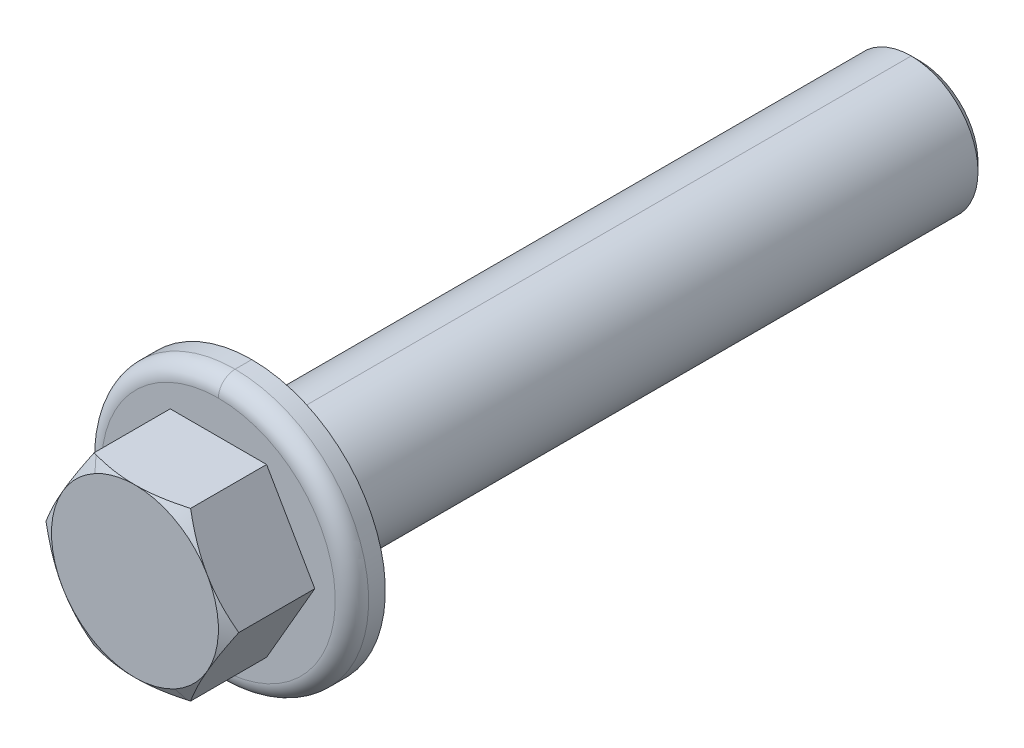
ISO-10303-21;
HEADER;
FILE_DESCRIPTION(('STEP AP214'),'2;1');
FILE_NAME('part.step','',(''),(''),'','','');
FILE_SCHEMA(('AUTOMOTIVE_DESIGN { 1 0 10303 214 1 1 1 1 }'));
ENDSEC;
DATA;
#1=APPLICATION_CONTEXT('core data for automotive mechanical design processes');
#2=APPLICATION_PROTOCOL_DEFINITION('international standard','automotive_design',2000,#1);
#3=PRODUCT_CONTEXT('',#1,'mechanical');
#4=PRODUCT('Part','Part','',(#3));
#5=PRODUCT_RELATED_PRODUCT_CATEGORY('part','',(#4));
#6=PRODUCT_DEFINITION_FORMATION('','',#4);
#7=PRODUCT_DEFINITION_CONTEXT('part definition',#1,'design');
#8=PRODUCT_DEFINITION('design','',#6,#7);
#9=PRODUCT_DEFINITION_SHAPE('','',#8);
#10=(LENGTH_UNIT() NAMED_UNIT(*) SI_UNIT(.MILLI.,.METRE.));
#11=(NAMED_UNIT(*) PLANE_ANGLE_UNIT() SI_UNIT($,.RADIAN.));
#12=(NAMED_UNIT(*) SI_UNIT($,.STERADIAN.) SOLID_ANGLE_UNIT());
#13=UNCERTAINTY_MEASURE_WITH_UNIT(LENGTH_MEASURE(1.E-05),#10,'distance_accuracy_value','');
#14=(GEOMETRIC_REPRESENTATION_CONTEXT(3) GLOBAL_UNCERTAINTY_ASSIGNED_CONTEXT((#13)) GLOBAL_UNIT_ASSIGNED_CONTEXT((#10,
#11,#12)) REPRESENTATION_CONTEXT('',''));
#15=CARTESIAN_POINT('',(0.,0.,0.));
#16=DIRECTION('',(0.,0.,1.));
#17=DIRECTION('',(1.,0.,0.));
#18=AXIS2_PLACEMENT_3D('',#15,#16,#17);
#19=CARTESIAN_POINT('',(62.,67.,26.1));
#20=DIRECTION('',(0.,0.,1.));
#21=DIRECTION('',(-1.,0.,0.));
#22=AXIS2_PLACEMENT_3D('',#19,#20,#21);
#23=TOROIDAL_SURFACE('',#22,4.25,0.25);
#24=CARTESIAN_POINT('',(62.,67.,26.35));
#25=DIRECTION('',(0.,0.,-1.));
#26=DIRECTION('',(1.,0.,0.));
#27=AXIS2_PLACEMENT_3D('',#24,#25,#26);
#28=CIRCLE('',#27,4.25);
#29=CARTESIAN_POINT('',(62.,71.25,26.35));
#30=VERTEX_POINT('',#29);
#31=CARTESIAN_POINT('',(62.,62.75,26.35));
#32=VERTEX_POINT('',#31);
#33=EDGE_CURVE('E11',#30,#32,#28,.T.);
#34=ORIENTED_EDGE('',*,*,#33,.T.);
#35=CARTESIAN_POINT('',(62.,62.75,26.1));
#36=DIRECTION('',(-1.,0.,0.));
#37=DIRECTION('',(0.,0.,1.));
#38=AXIS2_PLACEMENT_3D('',#35,#36,#37);
#39=CIRCLE('',#38,0.25);
#40=CARTESIAN_POINT('',(62.,63.,26.1));
#41=VERTEX_POINT('',#40);
#42=EDGE_CURVE('E33',#32,#41,#39,.T.);
#43=ORIENTED_EDGE('',*,*,#42,.T.);
#44=CARTESIAN_POINT('',(62.,67.,26.1));
#45=DIRECTION('',(0.,0.,-1.));
#46=DIRECTION('',(1.,0.,0.));
#47=AXIS2_PLACEMENT_3D('',#44,#45,#46);
#48=CIRCLE('',#47,4.);
#49=CARTESIAN_POINT('',(62.,71.,26.1));
#50=VERTEX_POINT('',#49);
#51=EDGE_CURVE('E461',#50,#41,#48,.T.);
#52=ORIENTED_EDGE('',*,*,#51,.F.);
#53=CARTESIAN_POINT('',(62.,71.25,26.1));
#54=DIRECTION('',(1.,0.,0.));
#55=DIRECTION('',(0.,0.,1.));
#56=AXIS2_PLACEMENT_3D('',#53,#54,#55);
#57=CIRCLE('',#56,0.25);
#58=EDGE_CURVE('E457',#30,#50,#57,.T.);
#59=ORIENTED_EDGE('',*,*,#58,.F.);
#60=EDGE_LOOP('',(#34,#43,#52,#59));
#61=FACE_BOUND('',#60,.T.);
#62=ADVANCED_FACE('F17',(#61),#23,.F.);
#63=CARTESIAN_POINT('',(62.,67.,26.1));
#64=DIRECTION('',(0.,0.,1.));
#65=DIRECTION('',(0.,-1.,0.));
#66=AXIS2_PLACEMENT_3D('',#63,#64,#65);
#67=TOROIDAL_SURFACE('',#66,4.25,0.25);
#68=CARTESIAN_POINT('',(62.,67.,26.35));
#69=DIRECTION('',(0.,0.,-1.));
#70=DIRECTION('',(1.,0.,0.));
#71=AXIS2_PLACEMENT_3D('',#68,#69,#70);
#72=CIRCLE('',#71,4.25);
#73=EDGE_CURVE('E454',#32,#30,#72,.T.);
#74=ORIENTED_EDGE('',*,*,#73,.T.);
#75=ORIENTED_EDGE('',*,*,#58,.T.);
#76=CARTESIAN_POINT('',(62.,67.,26.1));
#77=DIRECTION('',(0.,0.,-1.));
#78=DIRECTION('',(1.,0.,0.));
#79=AXIS2_PLACEMENT_3D('',#76,#77,#78);
#80=CIRCLE('',#79,4.);
#81=EDGE_CURVE('E465',#41,#50,#80,.T.);
#82=ORIENTED_EDGE('',*,*,#81,.F.);
#83=ORIENTED_EDGE('',*,*,#42,.F.);
#84=EDGE_LOOP('',(#74,#75,#82,#83));
#85=FACE_BOUND('',#84,.T.);
#86=ADVANCED_FACE('F311',(#85),#67,.F.);
#87=CARTESIAN_POINT('',(62.,67.,6.35));
#88=DIRECTION('',(0.,0.,1.));
#89=DIRECTION('',(-1.,0.,0.));
#90=AXIS2_PLACEMENT_3D('',#87,#88,#89);
#91=CYLINDRICAL_SURFACE('',#90,4.);
#92=DIRECTION('',(0.,0.,-1.));
#93=VECTOR('',#92,1.);
#94=CARTESIAN_POINT('',(62.,71.,6.35));
#95=LINE('',#94,#93);
#96=CARTESIAN_POINT('',(62.,71.,-13.15));
#97=VERTEX_POINT('',#96);
#98=EDGE_CURVE('E468',#50,#97,#95,.T.);
#99=ORIENTED_EDGE('',*,*,#98,.F.);
#100=ORIENTED_EDGE('',*,*,#51,.T.);
#101=DIRECTION('',(0.,0.,-1.));
#102=VECTOR('',#101,1.);
#103=CARTESIAN_POINT('',(62.,63.,6.35));
#104=LINE('',#103,#102);
#105=CARTESIAN_POINT('',(62.,63.,-13.15));
#106=VERTEX_POINT('',#105);
#107=EDGE_CURVE('E472',#41,#106,#104,.T.);
#108=ORIENTED_EDGE('',*,*,#107,.T.);
#109=CARTESIAN_POINT('',(62.,67.,-13.15));
#110=DIRECTION('',(0.,0.,1.));
#111=DIRECTION('',(1.,0.,0.));
#112=AXIS2_PLACEMENT_3D('',#109,#110,#111);
#113=CIRCLE('',#112,4.);
#114=EDGE_CURVE('E467',#106,#97,#113,.T.);
#115=ORIENTED_EDGE('',*,*,#114,.T.);
#116=EDGE_LOOP('',(#99,#100,#108,#115));
#117=FACE_BOUND('',#116,.T.);
#118=ADVANCED_FACE('F317',(#117),#91,.T.);
#119=CARTESIAN_POINT('',(62.,67.,6.35));
#120=DIRECTION('',(0.,0.,1.));
#121=DIRECTION('',(-1.,0.,0.));
#122=AXIS2_PLACEMENT_3D('',#119,#120,#121);
#123=CYLINDRICAL_SURFACE('',#122,4.);
#124=ORIENTED_EDGE('',*,*,#107,.F.);
#125=ORIENTED_EDGE('',*,*,#81,.T.);
#126=ORIENTED_EDGE('',*,*,#98,.T.);
#127=CARTESIAN_POINT('',(62.,67.,-13.15));
#128=DIRECTION('',(0.,0.,1.));
#129=DIRECTION('',(1.,0.,0.));
#130=AXIS2_PLACEMENT_3D('',#127,#128,#129);
#131=CIRCLE('',#130,4.);
#132=EDGE_CURVE('E471',#97,#106,#131,.T.);
#133=ORIENTED_EDGE('',*,*,#132,.T.);
#134=EDGE_LOOP('',(#124,#125,#126,#133));
#135=FACE_BOUND('',#134,.T.);
#136=ADVANCED_FACE('F322',(#135),#123,.T.);
#137=CARTESIAN_POINT('',(62.,67.,-17.15));
#138=DIRECTION('',(0.,0.,1.));
#139=DIRECTION('',(-0.274319226534887,-0.961638685761602,0.));
#140=AXIS2_PLACEMENT_3D('',#137,#138,#139);
#141=CONICAL_SURFACE('',#140,0.,0.785398163396999);
#142=DIRECTION('',(1.71127574250888E-07,0.707106781186537,-0.707106781186537));
#143=VECTOR('',#142,1.);
#144=CARTESIAN_POINT('',(61.9999990924589,63.25,-13.4));
#145=LINE('',#144,#143);
#146=CARTESIAN_POINT('',(61.999999738007,63.5,-13.65));
#147=VERTEX_POINT('',#146);
#148=EDGE_CURVE('E478',#106,#147,#145,.T.);
#149=ORIENTED_EDGE('',*,*,#148,.T.);
#150=CARTESIAN_POINT('',(62.,67.,-13.65));
#151=DIRECTION('',(0.,0.,1.));
#152=DIRECTION('',(-0.961638685761684,0.2743192265346,0.));
#153=AXIS2_PLACEMENT_3D('',#150,#151,#152);
#154=CIRCLE('',#153,3.5);
#155=CARTESIAN_POINT('',(62.,70.5,-13.65));
#156=VERTEX_POINT('',#155);
#157=EDGE_CURVE('E481',#147,#156,#154,.T.);
#158=ORIENTED_EDGE('',*,*,#157,.T.);
#159=DIRECTION('',(0.,-0.707106781186548,-0.707106781186548));
#160=VECTOR('',#159,1.);
#161=CARTESIAN_POINT('',(62.,70.75,-13.4));
#162=LINE('',#161,#160);
#163=EDGE_CURVE('E484',#97,#156,#162,.T.);
#164=ORIENTED_EDGE('',*,*,#163,.F.);
#165=ORIENTED_EDGE('',*,*,#114,.F.);
#166=EDGE_LOOP('',(#149,#158,#164,#165));
#167=FACE_BOUND('',#166,.T.);
#168=ADVANCED_FACE('F326',(#167),#141,.T.);
#169=CARTESIAN_POINT('',(61.9999999999988,66.9999999999992,-17.15));
#170=DIRECTION('',(3.05977465587E-13,1.97175609173E-13,1.));
#171=DIRECTION('',(0.,1.,-1.97175609173E-13));
#172=AXIS2_PLACEMENT_3D('',#169,#170,#171);
#173=CONICAL_SURFACE('',#172,0.,0.785398163396999);
#174=ORIENTED_EDGE('',*,*,#163,.T.);
#175=CARTESIAN_POINT('',(62.,67.,-13.6499999999993));
#176=DIRECTION('',(3.05977465587E-13,0.,1.));
#177=DIRECTION('',(-1.,0.,3.05977465587E-13));
#178=AXIS2_PLACEMENT_3D('',#175,#176,#177);
#179=CIRCLE('',#178,3.5);
#180=EDGE_CURVE('E352',#156,#147,#179,.T.);
#181=ORIENTED_EDGE('',*,*,#180,.T.);
#182=ORIENTED_EDGE('',*,*,#148,.F.);
#183=ORIENTED_EDGE('',*,*,#132,.F.);
#184=EDGE_LOOP('',(#174,#181,#182,#183));
#185=FACE_BOUND('',#184,.T.);
#186=ADVANCED_FACE('F330',(#185),#173,.T.);
#187=CARTESIAN_POINT('',(62.,67.,-13.65));
#188=DIRECTION('',(0.,0.,1.));
#189=DIRECTION('',(0.,-1.,0.));
#190=AXIS2_PLACEMENT_3D('',#187,#188,#189);
#191=PLANE('',#190);
#192=ORIENTED_EDGE('',*,*,#180,.F.);
#193=ORIENTED_EDGE('',*,*,#157,.F.);
#194=EDGE_LOOP('',(#192,#193));
#195=FACE_BOUND('',#194,.T.);
#196=ADVANCED_FACE('F334',(#195),#191,.F.);
#197=CARTESIAN_POINT('',(62.,67.,33.35));
#198=DIRECTION('',(0.,0.,1.));
#199=DIRECTION('',(-1.,0.,0.));
#200=AXIS2_PLACEMENT_3D('',#197,#198,#199);
#201=PLANE('',#200);
#202=CARTESIAN_POINT('',(62.,67.,33.35));
#203=DIRECTION('',(0.,0.,1.));
#204=DIRECTION('',(1.,0.,0.));
#205=AXIS2_PLACEMENT_3D('',#202,#203,#204);
#206=CIRCLE('',#205,5.);
#207=CARTESIAN_POINT('',(57.6698729810774,69.5000000000015,33.3499999999994));
#208=VERTEX_POINT('',#207);
#209=CARTESIAN_POINT('',(57.6698729810772,64.4999999999984,33.3499999999993));
#210=VERTEX_POINT('',#209);
#211=EDGE_CURVE('E347',#208,#210,#206,.T.);
#212=ORIENTED_EDGE('',*,*,#211,.T.);
#213=CARTESIAN_POINT('',(62.,67.,33.35));
#214=DIRECTION('',(0.,0.,1.));
#215=DIRECTION('',(1.,0.,0.));
#216=AXIS2_PLACEMENT_3D('',#213,#214,#215);
#217=CIRCLE('',#216,5.);
#218=CARTESIAN_POINT('',(62.,62.,33.35));
#219=VERTEX_POINT('',#218);
#220=EDGE_CURVE('E353',#210,#219,#217,.T.);
#221=ORIENTED_EDGE('',*,*,#220,.T.);
#222=CARTESIAN_POINT('',(62.,67.,33.35));
#223=DIRECTION('',(0.,0.,1.));
#224=DIRECTION('',(1.,0.,0.));
#225=AXIS2_PLACEMENT_3D('',#222,#223,#224);
#226=CIRCLE('',#225,5.);
#227=CARTESIAN_POINT('',(64.39712769302,62.61208719055,33.35));
#228=VERTEX_POINT('',#227);
#229=EDGE_CURVE('E368',#219,#228,#226,.T.);
#230=ORIENTED_EDGE('',*,*,#229,.T.);
#231=CARTESIAN_POINT('',(62.,67.,33.35));
#232=DIRECTION('',(0.,0.,1.));
#233=DIRECTION('',(1.,0.,0.));
#234=AXIS2_PLACEMENT_3D('',#231,#232,#233);
#235=CIRCLE('',#234,5.);
#236=CARTESIAN_POINT('',(66.3301270189226,64.4999999999985,33.3499999999994));
#237=VERTEX_POINT('',#236);
#238=EDGE_CURVE('E372',#228,#237,#235,.T.);
#239=ORIENTED_EDGE('',*,*,#238,.T.);
#240=CARTESIAN_POINT('',(62.,67.,33.35));
#241=DIRECTION('',(0.,0.,1.));
#242=DIRECTION('',(1.,0.,0.));
#243=AXIS2_PLACEMENT_3D('',#240,#241,#242);
#244=CIRCLE('',#243,5.);
#245=CARTESIAN_POINT('',(66.3301270189228,69.5000000000016,33.3499999999993));
#246=VERTEX_POINT('',#245);
#247=EDGE_CURVE('E172',#237,#246,#244,.T.);
#248=ORIENTED_EDGE('',*,*,#247,.T.);
#249=CARTESIAN_POINT('',(62.,67.,33.35));
#250=DIRECTION('',(0.,0.,1.));
#251=DIRECTION('',(1.,0.,0.));
#252=AXIS2_PLACEMENT_3D('',#249,#250,#251);
#253=CIRCLE('',#252,5.);
#254=CARTESIAN_POINT('',(62.,72.,33.35));
#255=VERTEX_POINT('',#254);
#256=EDGE_CURVE('E147',#246,#255,#253,.T.);
#257=ORIENTED_EDGE('',*,*,#256,.T.);
#258=CARTESIAN_POINT('',(62.,67.,33.35));
#259=DIRECTION('',(0.,0.,1.));
#260=DIRECTION('',(1.,0.,0.));
#261=AXIS2_PLACEMENT_3D('',#258,#259,#260);
#262=CIRCLE('',#261,5.);
#263=CARTESIAN_POINT('',(59.60287230698,71.38791280945,33.35));
#264=VERTEX_POINT('',#263);
#265=EDGE_CURVE('E160',#255,#264,#262,.T.);
#266=ORIENTED_EDGE('',*,*,#265,.T.);
#267=CARTESIAN_POINT('',(62.,67.,33.35));
#268=DIRECTION('',(0.,0.,1.));
#269=DIRECTION('',(1.,0.,0.));
#270=AXIS2_PLACEMENT_3D('',#267,#268,#269);
#271=CIRCLE('',#270,5.);
#272=EDGE_CURVE('E166',#264,#208,#271,.T.);
#273=ORIENTED_EDGE('',*,*,#272,.T.);
#274=EDGE_LOOP('',(#212,#221,#230,#239,#248,#257,#266,#273));
#275=FACE_BOUND('',#274,.T.);
#276=ADVANCED_FACE('F169',(#275),#201,.T.);
#277=CARTESIAN_POINT('',(62.,67.,33.35));
#278=DIRECTION('',(0.,0.,-1.));
#279=DIRECTION('',(-0.479425538604204,0.877582561890372,0.));
#280=AXIS2_PLACEMENT_3D('',#277,#278,#279);
#281=CONICAL_SURFACE('',#280,5.,1.0471975512);
#282=ORIENTED_EDGE('',*,*,#211,.F.);
#283=CARTESIAN_POINT('',(56.2264973080997,66.9999999999987,32.9034180126159));
#284=CARTESIAN_POINT('',(56.3439874728937,67.2034989348116,32.9712680083953));
#285=CARTESIAN_POINT('',(56.4624185411482,67.4086275622228,33.0334304503109));
#286=CARTESIAN_POINT('',(56.7003246358149,67.8206930056156,33.143052797405));
#287=CARTESIAN_POINT('',(56.8197913638481,68.027615448383,33.19058540343));
#288=CARTESIAN_POINT('',(57.0001189318716,68.3399519582049,33.2489473736349));
#289=CARTESIAN_POINT('',(57.0604559135201,68.4444586759954,33.2662522919644));
#290=CARTESIAN_POINT('',(57.1814187345426,68.6539724278332,33.2962074663217));
#291=CARTESIAN_POINT('',(57.2420445662714,68.7589794486386,33.3088578448606));
#292=CARTESIAN_POINT('',(57.3638093349033,68.9698822144806,33.3292816727016));
#293=CARTESIAN_POINT('',(57.4249493197937,69.0757797746848,33.3370303207411));
#294=CARTESIAN_POINT('',(57.5473495321229,69.2877831612961,33.3474002095299));
#295=CARTESIAN_POINT('',(57.6086097809716,69.3938890247864,33.3500204348124));
#296=CARTESIAN_POINT('',(57.6698729810764,69.5000000000021,33.3499999999987));
#297=B_SPLINE_CURVE_WITH_KNOTS('',3,(#283,#284,#285,#286,#287,#288,#289,#290,#291,#292,#293,
#294,#295,#296),.UNSPECIFIED.,.F.,.F.,(4,2,2,2,2,2,4),(0.,0.734036658391582,1.46436443241698,
1.83000749078369,2.19564092445861,2.56310985866725,2.93065154716807),.UNSPECIFIED.);
#298=CARTESIAN_POINT('',(56.2264973080995,67.,32.9034180126159));
#299=VERTEX_POINT('',#298);
#300=EDGE_CURVE('E218',#299,#208,#297,.T.);
#301=ORIENTED_EDGE('',*,*,#300,.F.);
#302=CARTESIAN_POINT('',(57.6698729810761,64.4999999999978,33.3499999999985));
#303=CARTESIAN_POINT('',(57.6086097809713,64.6061109752135,33.3500204348122));
#304=CARTESIAN_POINT('',(57.5473495321225,64.7122168387038,33.3474002095297));
#305=CARTESIAN_POINT('',(57.4249493197933,64.9242202253151,33.3370303207409));
#306=CARTESIAN_POINT('',(57.3638093349029,65.0301177855192,33.3292816727013));
#307=CARTESIAN_POINT('',(57.2420445662711,65.2410205513613,33.3088578448603));
#308=CARTESIAN_POINT('',(57.1814187345423,65.3460275721666,33.2962074663215));
#309=CARTESIAN_POINT('',(57.0604559135197,65.5555413240045,33.2662522919642));
#310=CARTESIAN_POINT('',(57.0001189318713,65.6600480417949,33.2489473736347));
#311=CARTESIAN_POINT('',(56.8197913638478,65.9723845516168,33.1905854034298));
#312=CARTESIAN_POINT('',(56.7003246358146,66.1793069943842,33.1430527974048));
#313=CARTESIAN_POINT('',(56.4624185411479,66.591372437777,33.0334304503108));
#314=CARTESIAN_POINT('',(56.3439874728934,66.7965010651882,32.9712680083952));
#315=CARTESIAN_POINT('',(56.2264973080994,67.0000000000011,32.9034180126158));
#316=B_SPLINE_CURVE_WITH_KNOTS('',3,(#302,#303,#304,#305,#306,#307,#308,#309,#310,#311,#312,
#313,#314,#315),.UNSPECIFIED.,.F.,.F.,(4,2,2,2,2,2,4),(0.,0.367541688500816,0.735010622709449,
1.10064405638434,1.46628711475104,2.19661488877642,2.93065154716798),.UNSPECIFIED.);
#317=EDGE_CURVE('E234',#210,#299,#316,.T.);
#318=ORIENTED_EDGE('',*,*,#317,.F.);
#319=EDGE_LOOP('',(#282,#301,#318));
#320=FACE_BOUND('',#319,.T.);
#321=ADVANCED_FACE('F248',(#320),#281,.T.);
#322=CARTESIAN_POINT('',(62.,67.,33.35));
#323=DIRECTION('',(0.,0.,-1.));
#324=DIRECTION('',(-0.479425538604204,0.877582561890372,0.));
#325=AXIS2_PLACEMENT_3D('',#322,#323,#324);
#326=CONICAL_SURFACE('',#325,5.,1.0471975512);
#327=ORIENTED_EDGE('',*,*,#220,.F.);
#328=CARTESIAN_POINT('',(59.1132486540504,61.9999999999986,32.9034180126172));
#329=CARTESIAN_POINT('',(58.9957584892565,62.2034989348111,32.9712680083964));
#330=CARTESIAN_POINT('',(58.8773274210023,62.408627562222,33.0334304503118));
#331=CARTESIAN_POINT('',(58.6394213263359,62.8206930056142,33.1430527974055));
#332=CARTESIAN_POINT('',(58.519954598303,63.0276154483812,33.1905854034303));
#333=CARTESIAN_POINT('',(58.3396270302798,63.3399519582026,33.248947373635));
#334=CARTESIAN_POINT('',(58.2792900486314,63.4444586759929,33.2662522919645));
#335=CARTESIAN_POINT('',(58.158327227609,63.6539724278304,33.2962074663217));
#336=CARTESIAN_POINT('',(58.0977013958803,63.7589794486355,33.3088578448605));
#337=CARTESIAN_POINT('',(57.9759366272487,63.9698822144772,33.3292816727014));
#338=CARTESIAN_POINT('',(57.9147966423584,64.0757797746812,33.3370303207409));
#339=CARTESIAN_POINT('',(57.7923964300294,64.2877831612922,33.3474002095297));
#340=CARTESIAN_POINT('',(57.7311361811808,64.3938890247823,33.3500204348122));
#341=CARTESIAN_POINT('',(57.6698729810761,64.4999999999978,33.3499999999985));
#342=B_SPLINE_CURVE_WITH_KNOTS('',3,(#328,#329,#330,#331,#332,#333,#334,#335,#336,#337,#338,
#339,#340,#341),.UNSPECIFIED.,.F.,.F.,(4,2,2,2,2,2,4),(0.,0.734036658390324,1.46436443241447,
1.83000749078055,2.19564092445482,2.56310985866282,2.93065154716302),.UNSPECIFIED.);
#343=CARTESIAN_POINT('',(59.1132486540494,61.9999999999993,32.9034180126172));
#344=VERTEX_POINT('',#343);
#345=EDGE_CURVE('E225',#344,#210,#342,.T.);
#346=ORIENTED_EDGE('',*,*,#345,.F.);
#347=CARTESIAN_POINT('',(62.,62.,33.35));
#348=CARTESIAN_POINT('',(61.8774735997905,62.,33.3500204348137));
#349=CARTESIAN_POINT('',(61.7549531020931,62.,33.3474002095312));
#350=CARTESIAN_POINT('',(61.5101526774348,62.,33.3370303207424));
#351=CARTESIAN_POINT('',(61.3878727076541,62.,33.3292816727029));
#352=CARTESIAN_POINT('',(61.1443431703906,62.,33.3088578448619));
#353=CARTESIAN_POINT('',(61.0230915069331,62.,33.296207466323));
#354=CARTESIAN_POINT('',(60.7811658648881,62.,33.2662522919657));
#355=CARTESIAN_POINT('',(60.6604919015912,62.,33.2489473736362));
#356=CARTESIAN_POINT('',(60.2998367655444,62.,33.1905854034313));
#357=CARTESIAN_POINT('',(60.0609033094782,62.,33.1430527974063));
#358=CARTESIAN_POINT('',(59.5850911201451,62.,33.0334304503123));
#359=CARTESIAN_POINT('',(59.3482289836364,62.,32.9712680083967));
#360=CARTESIAN_POINT('',(59.1132486540484,62.,32.9034180126173));
#361=B_SPLINE_CURVE_WITH_KNOTS('',3,(#347,#348,#349,#350,#351,#352,#353,#354,#355,#356,#357,
#358,#359,#360),.UNSPECIFIED.,.F.,.F.,(4,2,2,2,2,2,4),(0.,0.367541688500726,0.73501062270927,
1.10064405638408,1.46628711475069,2.1966148887759,2.93065154716728),.UNSPECIFIED.);
#362=EDGE_CURVE('E256',#219,#344,#361,.T.);
#363=ORIENTED_EDGE('',*,*,#362,.F.);
#364=EDGE_LOOP('',(#327,#346,#363));
#365=FACE_BOUND('',#364,.T.);
#366=ADVANCED_FACE('F243',(#365),#326,.T.);
#367=CARTESIAN_POINT('',(62.,67.,33.35));
#368=DIRECTION('',(0.,0.,-1.));
#369=DIRECTION('',(-0.479425538604204,0.877582561890372,0.));
#370=AXIS2_PLACEMENT_3D('',#367,#368,#369);
#371=CONICAL_SURFACE('',#370,5.,1.0471975512);
#372=DIRECTION('',(-0.41519469565414,0.760008792515256,0.500000000000169));
#373=VECTOR('',#372,1.);
#374=CARTESIAN_POINT('',(65.46673429538,60.65418543787,32.0619216436));
#375=LINE('',#374,#373);
#376=CARTESIAN_POINT('',(64.7315124492214,62.,32.947315717563));
#377=VERTEX_POINT('',#376);
#378=EDGE_CURVE('E359',#377,#228,#375,.T.);
#379=ORIENTED_EDGE('',*,*,#378,.T.);
#380=ORIENTED_EDGE('',*,*,#229,.F.);
#381=CARTESIAN_POINT('',(64.7315124492221,62.,32.9473157175465));
#382=CARTESIAN_POINT('',(64.5087830955921,62.,33.0089939702807));
#383=CARTESIAN_POINT('',(64.2843656151654,62.,33.0652901400358));
#384=CARTESIAN_POINT('',(63.8336804916134,62.,33.1643275190334));
#385=CARTESIAN_POINT('',(63.6074263513307,62.,33.2071306974178));
#386=CARTESIAN_POINT('',(63.2661117097151,62.,33.2595623012601));
#387=CARTESIAN_POINT('',(63.1519541533146,62.,33.2750826376561));
#388=CARTESIAN_POINT('',(62.9231445974887,62.,33.3019229351795));
#389=CARTESIAN_POINT('',(62.8084926074751,62.,33.3132429759078));
#390=CARTESIAN_POINT('',(62.5783031408874,62.,33.3315033490443));
#391=CARTESIAN_POINT('',(62.4627640233955,62.,33.3384231328082));
#392=CARTESIAN_POINT('',(62.2314847871987,62.,33.3476799879821));
#393=CARTESIAN_POINT('',(62.1157446395792,62.,33.3500163340106));
#394=CARTESIAN_POINT('',(62.,62.,33.35));
#395=B_SPLINE_CURVE_WITH_KNOTS('',3,(#381,#382,#383,#384,#385,#386,#387,#388,#389,#390,#391,
#392,#393,#394),.UNSPECIFIED.,.F.,.F.,(4,2,2,2,2,2,4),(0.,0.693572709725178,1.38391201165258,
1.72946469135578,2.0750108220693,2.42215898329282,2.76936208027052),.UNSPECIFIED.);
#396=EDGE_CURVE('E262',#377,#219,#395,.T.);
#397=ORIENTED_EDGE('',*,*,#396,.F.);
#398=EDGE_LOOP('',(#379,#380,#397));
#399=FACE_BOUND('',#398,.T.);
#400=ADVANCED_FACE('F247',(#399),#371,.T.);
#401=CARTESIAN_POINT('',(62.,67.,33.35));
#402=DIRECTION('',(0.,0.,-1.));
#403=DIRECTION('',(-0.479425538604204,0.877582561890372,0.));
#404=AXIS2_PLACEMENT_3D('',#401,#402,#403);
#405=CONICAL_SURFACE('',#404,5.,1.0471975512);
#406=ORIENTED_EDGE('',*,*,#238,.F.);
#407=ORIENTED_EDGE('',*,*,#378,.F.);
#408=CARTESIAN_POINT('',(64.73151244922,62.,32.9473157175));
#409=CARTESIAN_POINT('',(64.78258781044,62.,32.9331782382));
#410=CARTESIAN_POINT('',(64.83431584594,62.,32.9185548376));
#411=CARTESIAN_POINT('',(64.88675134595,62.,32.9034180126));
#412=B_SPLINE_CURVE_WITH_KNOTS('',3,(#408,#409,#410,#411),.UNSPECIFIED.,.F.,.F.,(4,4),(0.,1.),.UNSPECIFIED.);
#413=CARTESIAN_POINT('',(64.8867513459489,61.999999999998,32.9034180126082));
#414=VERTEX_POINT('',#413);
#415=EDGE_CURVE('E362',#377,#414,#412,.T.);
#416=ORIENTED_EDGE('',*,*,#415,.T.);
#417=CARTESIAN_POINT('',(66.3301270189236,64.4999999999979,33.3499999999987));
#418=CARTESIAN_POINT('',(66.2688638188188,64.3938890247822,33.3500204348124));
#419=CARTESIAN_POINT('',(66.2076035699701,64.287783161292,33.3474002095299));
#420=CARTESIAN_POINT('',(66.0852033576409,64.0757797746808,33.3370303207411));
#421=CARTESIAN_POINT('',(66.0240633727506,63.9698822144768,33.3292816727016));
#422=CARTESIAN_POINT('',(65.9022986041188,63.7589794486348,33.3088578448606));
#423=CARTESIAN_POINT('',(65.8416727723901,63.6539724278295,33.2962074663217));
#424=CARTESIAN_POINT('',(65.7207099513676,63.4444586759918,33.2662522919645));
#425=CARTESIAN_POINT('',(65.6603729697191,63.3399519582014,33.248947373635));
#426=CARTESIAN_POINT('',(65.4800454016957,63.0276154483797,33.1905854034302));
#427=CARTESIAN_POINT('',(65.3605786736626,62.8206930056124,33.1430527974052));
#428=CARTESIAN_POINT('',(65.122672578996,62.4086275622198,33.0334304503113));
#429=CARTESIAN_POINT('',(65.0042415107417,62.2034989348087,32.9712680083957));
#430=CARTESIAN_POINT('',(64.8867513459477,61.9999999999959,32.9034180126164));
#431=B_SPLINE_CURVE_WITH_KNOTS('',3,(#417,#418,#419,#420,#421,#422,#423,#424,#425,#426,#427,
#428,#429,#430),.UNSPECIFIED.,.F.,.F.,(4,2,2,2,2,2,4),(0.,0.367541688500619,0.735010622709052,
1.10064405638374,1.46628711475024,2.19661488877521,2.93065154716638),.UNSPECIFIED.);
#432=EDGE_CURVE('E287',#237,#414,#431,.T.);
#433=ORIENTED_EDGE('',*,*,#432,.F.);
#434=EDGE_LOOP('',(#406,#407,#416,#433));
#435=FACE_BOUND('',#434,.T.);
#436=ADVANCED_FACE('F297',(#435),#405,.T.);
#437=CARTESIAN_POINT('',(62.,67.,33.35));
#438=DIRECTION('',(0.,0.,-1.));
#439=DIRECTION('',(-0.479425538604204,0.877582561890372,0.));
#440=AXIS2_PLACEMENT_3D('',#437,#438,#439);
#441=CONICAL_SURFACE('',#440,5.,1.0471975512);
#442=ORIENTED_EDGE('',*,*,#247,.F.);
#443=CARTESIAN_POINT('',(67.7735026919003,67.0000000000013,32.9034180126159));
#444=CARTESIAN_POINT('',(67.6560125271063,66.7965010651884,32.9712680083953));
#445=CARTESIAN_POINT('',(67.5375814588518,66.5913724377772,33.0334304503109));
#446=CARTESIAN_POINT('',(67.2996753641851,66.1793069943844,33.143052797405));
#447=CARTESIAN_POINT('',(67.1802086361519,65.972384551617,33.19058540343));
#448=CARTESIAN_POINT('',(66.9998810681284,65.6600480417951,33.2489473736349));
#449=CARTESIAN_POINT('',(66.9395440864799,65.5555413240046,33.2662522919644));
#450=CARTESIAN_POINT('',(66.8185812654574,65.3460275721668,33.2962074663217));
#451=CARTESIAN_POINT('',(66.7579554337286,65.2410205513614,33.3088578448606));
#452=CARTESIAN_POINT('',(66.6361906650967,65.0301177855194,33.3292816727016));
#453=CARTESIAN_POINT('',(66.5750506802063,64.9242202253152,33.3370303207411));
#454=CARTESIAN_POINT('',(66.4526504678771,64.7122168387039,33.3474002095299));
#455=CARTESIAN_POINT('',(66.3913902190284,64.6061109752136,33.3500204348124));
#456=CARTESIAN_POINT('',(66.3301270189236,64.4999999999979,33.3499999999987));
#457=B_SPLINE_CURVE_WITH_KNOTS('',3,(#443,#444,#445,#446,#447,#448,#449,#450,#451,#452,#453,
#454,#455,#456),.UNSPECIFIED.,.F.,.F.,(4,2,2,2,2,2,4),(0.,0.734036658391596,1.46436443241699,
1.83000749078369,2.1956409244586,2.56310985866725,2.93065154716808),.UNSPECIFIED.);
#458=CARTESIAN_POINT('',(67.7735026919005,67.,32.9034180126159));
#459=VERTEX_POINT('',#458);
#460=EDGE_CURVE('E268',#459,#237,#457,.T.);
#461=ORIENTED_EDGE('',*,*,#460,.F.);
#462=CARTESIAN_POINT('',(66.3301270189239,69.5000000000023,33.3499999999985));
#463=CARTESIAN_POINT('',(66.3913902190287,69.3938890247866,33.3500204348122));
#464=CARTESIAN_POINT('',(66.4526504678774,69.2877831612963,33.3474002095297));
#465=CARTESIAN_POINT('',(66.5750506802066,69.075779774685,33.3370303207409));
#466=CARTESIAN_POINT('',(66.636190665097,68.9698822144809,33.3292816727014));
#467=CARTESIAN_POINT('',(66.7579554337289,68.7589794486388,33.3088578448604));
#468=CARTESIAN_POINT('',(66.8185812654577,68.6539724278335,33.2962074663215));
#469=CARTESIAN_POINT('',(66.9395440864802,68.4444586759956,33.2662522919642));
#470=CARTESIAN_POINT('',(66.9998810681287,68.3399519582051,33.2489473736347));
#471=CARTESIAN_POINT('',(67.1802086361522,68.0276154483833,33.1905854034298));
#472=CARTESIAN_POINT('',(67.2996753641854,67.8206930056159,33.1430527974048));
#473=CARTESIAN_POINT('',(67.5375814588521,67.408627562223,33.0334304503108));
#474=CARTESIAN_POINT('',(67.6560125271065,67.2034989348118,32.9712680083952));
#475=CARTESIAN_POINT('',(67.7735026919006,66.999999999999,32.9034180126158));
#476=B_SPLINE_CURVE_WITH_KNOTS('',3,(#462,#463,#464,#465,#466,#467,#468,#469,#470,#471,#472,
#473,#474,#475),.UNSPECIFIED.,.F.,.F.,(4,2,2,2,2,2,4),(0.,0.367541688500815,0.735010622709453,
1.10064405638436,1.46628711475105,2.19661488877643,2.93065154716798),.UNSPECIFIED.);
#477=EDGE_CURVE('E188',#246,#459,#476,.T.);
#478=ORIENTED_EDGE('',*,*,#477,.F.);
#479=EDGE_LOOP('',(#442,#461,#478));
#480=FACE_BOUND('',#479,.T.);
#481=ADVANCED_FACE('F300',(#480),#441,.T.);
#482=CARTESIAN_POINT('',(62.,67.,33.35));
#483=DIRECTION('',(0.,0.,-1.));
#484=DIRECTION('',(-0.479425538604204,0.877582561890372,0.));
#485=AXIS2_PLACEMENT_3D('',#482,#483,#484);
#486=CONICAL_SURFACE('',#485,5.,1.0471975512);
#487=ORIENTED_EDGE('',*,*,#256,.F.);
#488=CARTESIAN_POINT('',(64.8867513459496,72.0000000000014,32.9034180126172));
#489=CARTESIAN_POINT('',(65.0042415107435,71.7965010651889,32.9712680083964));
#490=CARTESIAN_POINT('',(65.1226725789977,71.591372437778,33.0334304503118));
#491=CARTESIAN_POINT('',(65.360578673664,71.1793069943858,33.1430527974055));
#492=CARTESIAN_POINT('',(65.480045401697,70.9723845516188,33.1905854034303));
#493=CARTESIAN_POINT('',(65.6603729697202,70.6600480417974,33.248947373635));
#494=CARTESIAN_POINT('',(65.7207099513686,70.5555413240071,33.2662522919645));
#495=CARTESIAN_POINT('',(65.841672772391,70.3460275721696,33.2962074663217));
#496=CARTESIAN_POINT('',(65.9022986041197,70.2410205513645,33.3088578448605));
#497=CARTESIAN_POINT('',(66.0240633727513,70.0301177855227,33.3292816727014));
#498=CARTESIAN_POINT('',(66.0852033576416,69.9242202253188,33.3370303207409));
#499=CARTESIAN_POINT('',(66.2076035699706,69.7122168387078,33.3474002095297));
#500=CARTESIAN_POINT('',(66.2688638188192,69.6061109752177,33.3500204348122));
#501=CARTESIAN_POINT('',(66.3301270189239,69.5000000000022,33.3499999999985));
#502=B_SPLINE_CURVE_WITH_KNOTS('',3,(#488,#489,#490,#491,#492,#493,#494,#495,#496,#497,#498,
#499,#500,#501),.UNSPECIFIED.,.F.,.F.,(4,2,2,2,2,2,4),(0.,0.734036658390302,1.46436443241444,
1.83000749078053,2.19564092445481,2.56310985866282,2.93065154716301),.UNSPECIFIED.);
#503=CARTESIAN_POINT('',(64.8867513459506,72.,32.9034180126172));
#504=VERTEX_POINT('',#503);
#505=EDGE_CURVE('E150',#504,#246,#502,.T.);
#506=ORIENTED_EDGE('',*,*,#505,.F.);
#507=CARTESIAN_POINT('',(62.,72.,33.35));
#508=CARTESIAN_POINT('',(62.1225264002095,72.,33.3500204348137));
#509=CARTESIAN_POINT('',(62.2450468979069,72.,33.3474002095312));
#510=CARTESIAN_POINT('',(62.4898473225652,72.,33.3370303207424));
#511=CARTESIAN_POINT('',(62.6121272923459,72.,33.3292816727029));
#512=CARTESIAN_POINT('',(62.8556568296094,72.,33.3088578448619));
#513=CARTESIAN_POINT('',(62.9769084930669,72.,33.296207466323));
#514=CARTESIAN_POINT('',(63.2188341351119,72.,33.2662522919657));
#515=CARTESIAN_POINT('',(63.3395080984088,72.,33.2489473736362));
#516=CARTESIAN_POINT('',(63.7001632344556,72.,33.1905854034313));
#517=CARTESIAN_POINT('',(63.9390966905218,72.,33.1430527974063));
#518=CARTESIAN_POINT('',(64.4149088798549,72.,33.0334304503123));
#519=CARTESIAN_POINT('',(64.6517710163636,72.,32.9712680083967));
#520=CARTESIAN_POINT('',(64.8867513459516,72.,32.9034180126173));
#521=B_SPLINE_CURVE_WITH_KNOTS('',3,(#507,#508,#509,#510,#511,#512,#513,#514,#515,#516,#517,
#518,#519,#520),.UNSPECIFIED.,.F.,.F.,(4,2,2,2,2,2,4),(0.,0.367541688500726,0.73501062270927,
1.10064405638407,1.46628711475069,2.19661488877589,2.93065154716729),.UNSPECIFIED.);
#522=EDGE_CURVE('E21',#255,#504,#521,.T.);
#523=ORIENTED_EDGE('',*,*,#522,.F.);
#524=EDGE_LOOP('',(#487,#506,#523));
#525=FACE_BOUND('',#524,.T.);
#526=ADVANCED_FACE('F145',(#525),#486,.T.);
#527=CARTESIAN_POINT('',(62.,67.,33.35));
#528=DIRECTION('',(0.,0.,-1.));
#529=DIRECTION('',(-0.479425538604204,0.877582561890372,0.));
#530=AXIS2_PLACEMENT_3D('',#527,#528,#529);
#531=CONICAL_SURFACE('',#530,5.,1.0471975512);
#532=DIRECTION('',(0.41519469565414,-0.760008792515256,0.500000000000169));
#533=VECTOR('',#532,1.);
#534=CARTESIAN_POINT('',(58.53326570462,73.34581456213,32.0619216436));
#535=LINE('',#534,#533);
#536=CARTESIAN_POINT('',(59.2684875507787,72.,32.947315717563));
#537=VERTEX_POINT('',#536);
#538=EDGE_CURVE('E163',#537,#264,#535,.T.);
#539=ORIENTED_EDGE('',*,*,#538,.T.);
#540=ORIENTED_EDGE('',*,*,#265,.F.);
#541=CARTESIAN_POINT('',(59.2684875507779,72.,32.9473157175465));
#542=CARTESIAN_POINT('',(59.4912169044079,72.,33.0089939702807));
#543=CARTESIAN_POINT('',(59.7156343848346,72.,33.0652901400358));
#544=CARTESIAN_POINT('',(60.1663195083866,72.,33.1643275190334));
#545=CARTESIAN_POINT('',(60.3925736486693,72.,33.2071306974178));
#546=CARTESIAN_POINT('',(60.7338882902849,72.,33.2595623012601));
#547=CARTESIAN_POINT('',(60.8480458466854,72.,33.2750826376561));
#548=CARTESIAN_POINT('',(61.0768554025112,72.,33.3019229351795));
#549=CARTESIAN_POINT('',(61.1915073925249,72.,33.3132429759078));
#550=CARTESIAN_POINT('',(61.4216968591126,72.,33.3315033490444));
#551=CARTESIAN_POINT('',(61.5372359766045,72.,33.3384231328082));
#552=CARTESIAN_POINT('',(61.7685152128013,72.,33.3476799879822));
#553=CARTESIAN_POINT('',(61.8842553604208,72.,33.3500163340106));
#554=CARTESIAN_POINT('',(62.,72.,33.35));
#555=B_SPLINE_CURVE_WITH_KNOTS('',3,(#541,#542,#543,#544,#545,#546,#547,#548,#549,#550,#551,
#552,#553,#554),.UNSPECIFIED.,.F.,.F.,(4,2,2,2,2,2,4),(0.,0.693572709725173,1.38391201165257,
1.72946469135578,2.07501082206928,2.4221589832928,2.76936208027052),.UNSPECIFIED.);
#556=EDGE_CURVE('E155',#537,#255,#555,.T.);
#557=ORIENTED_EDGE('',*,*,#556,.F.);
#558=EDGE_LOOP('',(#539,#540,#557));
#559=FACE_BOUND('',#558,.T.);
#560=ADVANCED_FACE('F161',(#559),#531,.T.);
#561=CARTESIAN_POINT('',(62.,67.,33.35));
#562=DIRECTION('',(0.,0.,-1.));
#563=DIRECTION('',(-0.479425538604204,0.877582561890372,0.));
#564=AXIS2_PLACEMENT_3D('',#561,#562,#563);
#565=CONICAL_SURFACE('',#564,5.,1.0471975512);
#566=ORIENTED_EDGE('',*,*,#272,.F.);
#567=ORIENTED_EDGE('',*,*,#538,.F.);
#568=CARTESIAN_POINT('',(59.26848755078,72.,32.9473157175));
#569=CARTESIAN_POINT('',(59.21741218956,72.,32.9331782382));
#570=CARTESIAN_POINT('',(59.16568415406,72.,32.9185548376));
#571=CARTESIAN_POINT('',(59.11324865405,72.,32.9034180126));
#572=B_SPLINE_CURVE_WITH_KNOTS('',3,(#568,#569,#570,#571),.UNSPECIFIED.,.F.,.F.,(4,4),(0.,1.),.UNSPECIFIED.);
#573=CARTESIAN_POINT('',(59.1132486540512,72.0000000000021,32.9034180126082));
#574=VERTEX_POINT('',#573);
#575=EDGE_CURVE('E178',#537,#574,#572,.T.);
#576=ORIENTED_EDGE('',*,*,#575,.T.);
#577=CARTESIAN_POINT('',(57.6698729810764,69.5000000000021,33.3499999999987));
#578=CARTESIAN_POINT('',(57.7311361811812,69.6061109752177,33.3500204348124));
#579=CARTESIAN_POINT('',(57.7923964300299,69.712216838708,33.3474002095299));
#580=CARTESIAN_POINT('',(57.9147966423591,69.9242202253192,33.3370303207411));
#581=CARTESIAN_POINT('',(57.9759366272494,70.0301177855232,33.3292816727016));
#582=CARTESIAN_POINT('',(58.0977013958812,70.2410205513652,33.3088578448606));
#583=CARTESIAN_POINT('',(58.1583272276099,70.3460275721705,33.2962074663218));
#584=CARTESIAN_POINT('',(58.2792900486324,70.5555413240082,33.2662522919645));
#585=CARTESIAN_POINT('',(58.3396270302809,70.6600480417986,33.248947373635));
#586=CARTESIAN_POINT('',(58.5199545983043,70.9723845516203,33.1905854034302));
#587=CARTESIAN_POINT('',(58.6394213263374,71.1793069943876,33.1430527974052));
#588=CARTESIAN_POINT('',(58.877327421004,71.5913724377803,33.0334304503113));
#589=CARTESIAN_POINT('',(58.9957584892584,71.7965010651914,32.9712680083957));
#590=CARTESIAN_POINT('',(59.1132486540524,72.0000000000041,32.9034180126164));
#591=B_SPLINE_CURVE_WITH_KNOTS('',3,(#577,#578,#579,#580,#581,#582,#583,#584,#585,#586,#587,
#588,#589,#590),.UNSPECIFIED.,.F.,.F.,(4,2,2,2,2,2,4),(0.,0.367541688500619,0.735010622709051,
1.10064405638375,1.46628711475025,2.19661488877526,2.93065154716643),.UNSPECIFIED.);
#592=EDGE_CURVE('E211',#208,#574,#591,.T.);
#593=ORIENTED_EDGE('',*,*,#592,.F.);
#594=EDGE_LOOP('',(#566,#567,#576,#593));
#595=FACE_BOUND('',#594,.T.);
#596=ADVANCED_FACE('F201',(#595),#565,.T.);
#597=CARTESIAN_POINT('',(59.11324865405,72.,26.35));
#598=DIRECTION('',(-0.866025403784329,0.50000000000019,0.));
#599=DIRECTION('',(0.50000000000019,0.866025403784329,0.));
#600=AXIS2_PLACEMENT_3D('',#597,#598,#599);
#601=PLANE('',#600);
#602=DIRECTION('',(0.,0.,1.));
#603=VECTOR('',#602,1.);
#604=CARTESIAN_POINT('',(56.2264973081,67.,30.6267090063));
#605=LINE('',#604,#603);
#606=CARTESIAN_POINT('',(56.2264973081,67.,28.35));
#607=VERTEX_POINT('',#606);
#608=EDGE_CURVE('E358',#607,#299,#605,.T.);
#609=ORIENTED_EDGE('',*,*,#608,.T.);
#610=ORIENTED_EDGE('',*,*,#300,.T.);
#611=ORIENTED_EDGE('',*,*,#592,.T.);
#612=DIRECTION('',(0.,0.,1.));
#613=VECTOR('',#612,1.);
#614=CARTESIAN_POINT('',(59.11324865405,72.,30.6267090063));
#615=LINE('',#614,#613);
#616=CARTESIAN_POINT('',(59.11324865405,72.,28.35));
#617=VERTEX_POINT('',#616);
#618=EDGE_CURVE('E179',#617,#574,#615,.T.);
#619=ORIENTED_EDGE('',*,*,#618,.F.);
#620=DIRECTION('',(-0.50000000000019,-0.866025403784329,0.));
#621=VECTOR('',#620,1.);
#622=CARTESIAN_POINT('',(57.66987298108,69.5,28.35));
#623=LINE('',#622,#621);
#624=EDGE_CURVE('E219',#617,#607,#623,.T.);
#625=ORIENTED_EDGE('',*,*,#624,.T.);
#626=EDGE_LOOP('',(#609,#610,#611,#619,#625));
#627=FACE_BOUND('',#626,.T.);
#628=ADVANCED_FACE('F206',(#627),#601,.T.);
#629=CARTESIAN_POINT('',(56.2264973081,67.,26.35));
#630=DIRECTION('',(-0.866025403784329,-0.50000000000019,0.));
#631=DIRECTION('',(-0.50000000000019,0.866025403784329,0.));
#632=AXIS2_PLACEMENT_3D('',#629,#630,#631);
#633=PLANE('',#632);
#634=DIRECTION('',(0.,0.,1.));
#635=VECTOR('',#634,1.);
#636=CARTESIAN_POINT('',(59.11324865405,62.,30.6267090063));
#637=LINE('',#636,#635);
#638=CARTESIAN_POINT('',(59.11324865405,62.,28.35));
#639=VERTEX_POINT('',#638);
#640=EDGE_CURVE('E233',#639,#344,#637,.T.);
#641=ORIENTED_EDGE('',*,*,#640,.T.);
#642=ORIENTED_EDGE('',*,*,#345,.T.);
#643=ORIENTED_EDGE('',*,*,#317,.T.);
#644=ORIENTED_EDGE('',*,*,#608,.F.);
#645=DIRECTION('',(0.50000000000019,-0.866025403784329,0.));
#646=VECTOR('',#645,1.);
#647=CARTESIAN_POINT('',(57.66987298108,64.5,28.35));
#648=LINE('',#647,#646);
#649=EDGE_CURVE('E386',#607,#639,#648,.T.);
#650=ORIENTED_EDGE('',*,*,#649,.T.);
#651=EDGE_LOOP('',(#641,#642,#643,#644,#650));
#652=FACE_BOUND('',#651,.T.);
#653=ADVANCED_FACE('F240',(#652),#633,.T.);
#654=CARTESIAN_POINT('',(59.11324865405,62.,26.35));
#655=DIRECTION('',(0.,-1.,0.));
#656=DIRECTION('',(-1.,0.,0.));
#657=AXIS2_PLACEMENT_3D('',#654,#655,#656);
#658=PLANE('',#657);
#659=DIRECTION('',(0.,0.,1.));
#660=VECTOR('',#659,1.);
#661=CARTESIAN_POINT('',(64.88675134595,62.,30.6267090063));
#662=LINE('',#661,#660);
#663=CARTESIAN_POINT('',(64.88675134595,62.,28.35));
#664=VERTEX_POINT('',#663);
#665=EDGE_CURVE('E383',#664,#414,#662,.T.);
#666=ORIENTED_EDGE('',*,*,#665,.T.);
#667=ORIENTED_EDGE('',*,*,#415,.F.);
#668=ORIENTED_EDGE('',*,*,#396,.T.);
#669=ORIENTED_EDGE('',*,*,#362,.T.);
#670=ORIENTED_EDGE('',*,*,#640,.F.);
#671=DIRECTION('',(1.,0.,0.));
#672=VECTOR('',#671,1.);
#673=CARTESIAN_POINT('',(62.0000000000029,62.,28.35));
#674=LINE('',#673,#672);
#675=EDGE_CURVE('E263',#639,#664,#674,.T.);
#676=ORIENTED_EDGE('',*,*,#675,.T.);
#677=EDGE_LOOP('',(#666,#667,#668,#669,#670,#676));
#678=FACE_BOUND('',#677,.T.);
#679=ADVANCED_FACE('F275',(#678),#658,.T.);
#680=CARTESIAN_POINT('',(64.88675134595,62.,26.35));
#681=DIRECTION('',(0.866025403784329,-0.50000000000019,0.));
#682=DIRECTION('',(-0.50000000000019,-0.866025403784329,0.));
#683=AXIS2_PLACEMENT_3D('',#680,#681,#682);
#684=PLANE('',#683);
#685=DIRECTION('',(0.,0.,1.));
#686=VECTOR('',#685,1.);
#687=CARTESIAN_POINT('',(67.7735026919,67.,30.6267090063));
#688=LINE('',#687,#686);
#689=CARTESIAN_POINT('',(67.7735026919,67.,28.35));
#690=VERTEX_POINT('',#689);
#691=EDGE_CURVE('E387',#690,#459,#688,.T.);
#692=ORIENTED_EDGE('',*,*,#691,.T.);
#693=ORIENTED_EDGE('',*,*,#460,.T.);
#694=ORIENTED_EDGE('',*,*,#432,.T.);
#695=ORIENTED_EDGE('',*,*,#665,.F.);
#696=DIRECTION('',(0.50000000000019,0.866025403784329,0.));
#697=VECTOR('',#696,1.);
#698=CARTESIAN_POINT('',(66.33012701892,64.5,28.35));
#699=LINE('',#698,#697);
#700=EDGE_CURVE('E292',#664,#690,#699,.T.);
#701=ORIENTED_EDGE('',*,*,#700,.T.);
#702=EDGE_LOOP('',(#692,#693,#694,#695,#701));
#703=FACE_BOUND('',#702,.T.);
#704=ADVANCED_FACE('F278',(#703),#684,.T.);
#705=CARTESIAN_POINT('',(67.7735026919,67.,26.35));
#706=DIRECTION('',(0.866025403784329,0.50000000000019,0.));
#707=DIRECTION('',(0.50000000000019,-0.866025403784329,0.));
#708=AXIS2_PLACEMENT_3D('',#705,#706,#707);
#709=PLANE('',#708);
#710=DIRECTION('',(0.,0.,1.));
#711=VECTOR('',#710,1.);
#712=CARTESIAN_POINT('',(64.88675134595,72.,30.6267090063));
#713=LINE('',#712,#711);
#714=CARTESIAN_POINT('',(64.88675134595,72.,28.35));
#715=VERTEX_POINT('',#714);
#716=EDGE_CURVE('E390',#715,#504,#713,.T.);
#717=ORIENTED_EDGE('',*,*,#716,.T.);
#718=ORIENTED_EDGE('',*,*,#505,.T.);
#719=ORIENTED_EDGE('',*,*,#477,.T.);
#720=ORIENTED_EDGE('',*,*,#691,.F.);
#721=DIRECTION('',(-0.50000000000019,0.866025403784329,0.));
#722=VECTOR('',#721,1.);
#723=CARTESIAN_POINT('',(66.33012701892,69.5,28.35));
#724=LINE('',#723,#722);
#725=EDGE_CURVE('E180',#690,#715,#724,.T.);
#726=ORIENTED_EDGE('',*,*,#725,.T.);
#727=EDGE_LOOP('',(#717,#718,#719,#720,#726));
#728=FACE_BOUND('',#727,.T.);
#729=ADVANCED_FACE('F283',(#728),#709,.T.);
#730=CARTESIAN_POINT('',(64.88675134595,72.,26.35));
#731=DIRECTION('',(0.,1.,0.));
#732=DIRECTION('',(1.,0.,0.));
#733=AXIS2_PLACEMENT_3D('',#730,#731,#732);
#734=PLANE('',#733);
#735=ORIENTED_EDGE('',*,*,#618,.T.);
#736=ORIENTED_EDGE('',*,*,#575,.F.);
#737=ORIENTED_EDGE('',*,*,#556,.T.);
#738=ORIENTED_EDGE('',*,*,#522,.T.);
#739=ORIENTED_EDGE('',*,*,#716,.F.);
#740=DIRECTION('',(-1.,0.,0.));
#741=VECTOR('',#740,1.);
#742=CARTESIAN_POINT('',(61.9999999999971,72.,28.35));
#743=LINE('',#742,#741);
#744=EDGE_CURVE('E156',#715,#617,#743,.T.);
#745=ORIENTED_EDGE('',*,*,#744,.T.);
#746=EDGE_LOOP('',(#735,#736,#737,#738,#739,#745));
#747=FACE_BOUND('',#746,.T.);
#748=ADVANCED_FACE('F176',(#747),#734,.T.);
#749=CARTESIAN_POINT('',(62.,67.,26.35));
#750=DIRECTION('',(0.,0.,1.));
#751=DIRECTION('',(0.,-1.,0.));
#752=AXIS2_PLACEMENT_3D('',#749,#750,#751);
#753=PLANE('',#752);
#754=CARTESIAN_POINT('',(62.,67.,26.35));
#755=DIRECTION('',(0.,0.,-1.));
#756=DIRECTION('',(1.,0.,0.));
#757=AXIS2_PLACEMENT_3D('',#754,#755,#756);
#758=CIRCLE('',#757,8.);
#759=CARTESIAN_POINT('',(62.,75.,26.35));
#760=VERTEX_POINT('',#759);
#761=CARTESIAN_POINT('',(62.,59.,26.35));
#762=VERTEX_POINT('',#761);
#763=EDGE_CURVE('E408',#760,#762,#758,.T.);
#764=ORIENTED_EDGE('',*,*,#763,.T.);
#765=CARTESIAN_POINT('',(62.,67.,26.35));
#766=DIRECTION('',(0.,0.,-1.));
#767=DIRECTION('',(1.,0.,0.));
#768=AXIS2_PLACEMENT_3D('',#765,#766,#767);
#769=CIRCLE('',#768,8.);
#770=EDGE_CURVE('E411',#762,#760,#769,.T.);
#771=ORIENTED_EDGE('',*,*,#770,.T.);
#772=EDGE_LOOP('',(#764,#771));
#773=FACE_BOUND('',#772,.T.);
#774=ORIENTED_EDGE('',*,*,#33,.F.);
#775=ORIENTED_EDGE('',*,*,#73,.F.);
#776=EDGE_LOOP('',(#774,#775));
#777=FACE_BOUND('',#776,.T.);
#778=ADVANCED_FACE('F448',(#773,#777),#753,.F.);
#779=CARTESIAN_POINT('',(62.,67.,28.35));
#780=DIRECTION('',(0.,0.,-1.));
#781=DIRECTION('',(0.,1.,0.));
#782=AXIS2_PLACEMENT_3D('',#779,#780,#781);
#783=PLANE('',#782);
#784=CARTESIAN_POINT('',(62.,67.,28.35));
#785=DIRECTION('',(0.,0.,-1.));
#786=DIRECTION('',(-1.,0.,0.));
#787=AXIS2_PLACEMENT_3D('',#784,#785,#786);
#788=CIRCLE('',#787,7.);
#789=CARTESIAN_POINT('',(62.,60.,28.35));
#790=VERTEX_POINT('',#789);
#791=CARTESIAN_POINT('',(61.9999999941743,74.,28.35));
#792=VERTEX_POINT('',#791);
#793=EDGE_CURVE('E414',#790,#792,#788,.T.);
#794=ORIENTED_EDGE('',*,*,#793,.F.);
#795=CARTESIAN_POINT('',(62.,67.,28.35));
#796=DIRECTION('',(0.,0.,-1.));
#797=DIRECTION('',(-1.,0.,0.));
#798=AXIS2_PLACEMENT_3D('',#795,#796,#797);
#799=CIRCLE('',#798,7.);
#800=EDGE_CURVE('E418',#792,#790,#799,.T.);
#801=ORIENTED_EDGE('',*,*,#800,.F.);
#802=EDGE_LOOP('',(#794,#801));
#803=FACE_BOUND('',#802,.T.);
#804=ORIENTED_EDGE('',*,*,#700,.F.);
#805=ORIENTED_EDGE('',*,*,#675,.F.);
#806=ORIENTED_EDGE('',*,*,#649,.F.);
#807=ORIENTED_EDGE('',*,*,#624,.F.);
#808=ORIENTED_EDGE('',*,*,#744,.F.);
#809=ORIENTED_EDGE('',*,*,#725,.F.);
#810=EDGE_LOOP('',(#804,#805,#806,#807,#808,#809));
#811=FACE_BOUND('',#810,.T.);
#812=ADVANCED_FACE('F451',(#803,#811),#783,.F.);
#813=CARTESIAN_POINT('',(62.,67.,27.35));
#814=DIRECTION('',(0.,0.,-1.));
#815=DIRECTION('',(1.,0.,0.));
#816=AXIS2_PLACEMENT_3D('',#813,#814,#815);
#817=CYLINDRICAL_SURFACE('',#816,8.);
#818=DIRECTION('',(0.,0.,-1.));
#819=VECTOR('',#818,1.);
#820=CARTESIAN_POINT('',(62.,59.,27.35));
#821=LINE('',#820,#819);
#822=CARTESIAN_POINT('',(62.,59.,27.35));
#823=VERTEX_POINT('',#822);
#824=EDGE_CURVE('E413',#823,#762,#821,.T.);
#825=ORIENTED_EDGE('',*,*,#824,.T.);
#826=ORIENTED_EDGE('',*,*,#763,.F.);
#827=DIRECTION('',(0.,0.,-1.));
#828=VECTOR('',#827,1.);
#829=CARTESIAN_POINT('',(62.,75.,27.35));
#830=LINE('',#829,#828);
#831=CARTESIAN_POINT('',(62.,75.,27.35));
#832=VERTEX_POINT('',#831);
#833=EDGE_CURVE('E425',#832,#760,#830,.T.);
#834=ORIENTED_EDGE('',*,*,#833,.F.);
#835=CARTESIAN_POINT('',(62.,67.,27.35));
#836=DIRECTION('',(0.,0.,-1.));
#837=DIRECTION('',(-1.,0.,0.));
#838=AXIS2_PLACEMENT_3D('',#835,#836,#837);
#839=CIRCLE('',#838,8.);
#840=EDGE_CURVE('E424',#832,#823,#839,.T.);
#841=ORIENTED_EDGE('',*,*,#840,.T.);
#842=EDGE_LOOP('',(#825,#826,#834,#841));
#843=FACE_BOUND('',#842,.T.);
#844=ADVANCED_FACE('F444',(#843),#817,.T.);
#845=CARTESIAN_POINT('',(62.,67.,27.35));
#846=DIRECTION('',(0.,0.,-1.));
#847=DIRECTION('',(1.,0.,0.));
#848=AXIS2_PLACEMENT_3D('',#845,#846,#847);
#849=CYLINDRICAL_SURFACE('',#848,8.);
#850=ORIENTED_EDGE('',*,*,#833,.T.);
#851=ORIENTED_EDGE('',*,*,#770,.F.);
#852=ORIENTED_EDGE('',*,*,#824,.F.);
#853=CARTESIAN_POINT('',(62.,67.,27.35));
#854=DIRECTION('',(0.,0.,-1.));
#855=DIRECTION('',(-1.,0.,0.));
#856=AXIS2_PLACEMENT_3D('',#853,#854,#855);
#857=CIRCLE('',#856,8.);
#858=EDGE_CURVE('E421',#823,#832,#857,.T.);
#859=ORIENTED_EDGE('',*,*,#858,.T.);
#860=EDGE_LOOP('',(#850,#851,#852,#859));
#861=FACE_BOUND('',#860,.T.);
#862=ADVANCED_FACE('F446',(#861),#849,.T.);
#863=CARTESIAN_POINT('',(62.,67.,27.35));
#864=DIRECTION('',(0.,0.,-1.));
#865=DIRECTION('',(0.354077366149015,-0.935216134795041,0.));
#866=AXIS2_PLACEMENT_3D('',#863,#864,#865);
#867=TOROIDAL_SURFACE('',#866,7.,1.);
#868=CARTESIAN_POINT('',(61.9999998667594,74.,27.35));
#869=DIRECTION('',(-1.,-1.90343657502E-08,0.));
#870=DIRECTION('',(0.,0.,1.));
#871=AXIS2_PLACEMENT_3D('',#868,#869,#870);
#872=CIRCLE('',#871,1.);
#873=EDGE_CURVE('E417',#792,#832,#872,.T.);
#874=ORIENTED_EDGE('',*,*,#873,.F.);
#875=ORIENTED_EDGE('',*,*,#800,.T.);
#876=CARTESIAN_POINT('',(62.,60.,27.35));
#877=DIRECTION('',(1.,0.,0.));
#878=DIRECTION('',(0.,0.,1.));
#879=AXIS2_PLACEMENT_3D('',#876,#877,#878);
#880=CIRCLE('',#879,1.);
#881=EDGE_CURVE('E416',#790,#823,#880,.T.);
#882=ORIENTED_EDGE('',*,*,#881,.T.);
#883=ORIENTED_EDGE('',*,*,#840,.F.);
#884=EDGE_LOOP('',(#874,#875,#882,#883));
#885=FACE_BOUND('',#884,.T.);
#886=ADVANCED_FACE('F437',(#885),#867,.T.);
#887=CARTESIAN_POINT('',(62.,67.,27.35));
#888=DIRECTION('',(0.,0.,-1.));
#889=DIRECTION('',(0.,1.,0.));
#890=AXIS2_PLACEMENT_3D('',#887,#888,#889);
#891=TOROIDAL_SURFACE('',#890,7.,1.);
#892=ORIENTED_EDGE('',*,*,#881,.F.);
#893=ORIENTED_EDGE('',*,*,#793,.T.);
#894=ORIENTED_EDGE('',*,*,#873,.T.);
#895=ORIENTED_EDGE('',*,*,#858,.F.);
#896=EDGE_LOOP('',(#892,#893,#894,#895));
#897=FACE_BOUND('',#896,.T.);
#898=ADVANCED_FACE('F19',(#897),#891,.T.);
#899=CLOSED_SHELL('',(#62,#86,#118,#136,#168,#186,#196,#276,#321,#366,#400,#436,#481,#526,#560,
#596,#628,#653,#679,#704,#729,#748,#778,#812,#844,#862,#886,#898));
#900=MANIFOLD_SOLID_BREP('B1',#899);
#901=ADVANCED_BREP_SHAPE_REPRESENTATION('',(#18,#900),#14);
#902=SHAPE_DEFINITION_REPRESENTATION(#9,#901);
ENDSEC;
END-ISO-10303-21;
